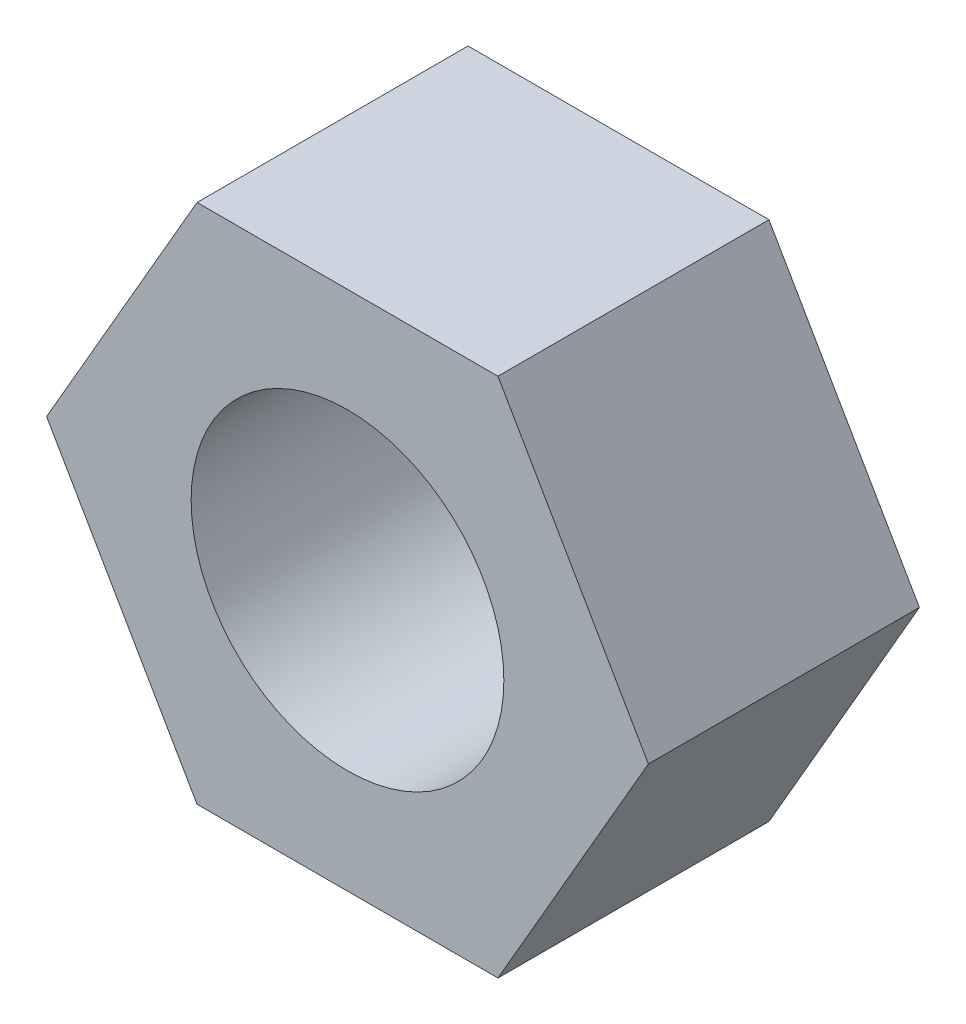
ISO-10303-21;
HEADER;
FILE_DESCRIPTION(('STEP AP214'),'2;1');
FILE_NAME('part.step','',(''),(''),'','','');
FILE_SCHEMA(('AUTOMOTIVE_DESIGN { 1 0 10303 214 1 1 1 1 }'));
ENDSEC;
DATA;
#1=APPLICATION_CONTEXT('core data for automotive mechanical design processes');
#2=APPLICATION_PROTOCOL_DEFINITION('international standard','automotive_design',2000,#1);
#3=PRODUCT_CONTEXT('',#1,'mechanical');
#4=PRODUCT('Part','Part','',(#3));
#5=PRODUCT_RELATED_PRODUCT_CATEGORY('part','',(#4));
#6=PRODUCT_DEFINITION_FORMATION('','',#4);
#7=PRODUCT_DEFINITION_CONTEXT('part definition',#1,'design');
#8=PRODUCT_DEFINITION('design','',#6,#7);
#9=PRODUCT_DEFINITION_SHAPE('','',#8);
#10=(LENGTH_UNIT() NAMED_UNIT(*) SI_UNIT(.MILLI.,.METRE.));
#11=(NAMED_UNIT(*) PLANE_ANGLE_UNIT() SI_UNIT($,.RADIAN.));
#12=(NAMED_UNIT(*) SI_UNIT($,.STERADIAN.) SOLID_ANGLE_UNIT());
#13=UNCERTAINTY_MEASURE_WITH_UNIT(LENGTH_MEASURE(1.E-05),#10,'distance_accuracy_value','');
#14=(GEOMETRIC_REPRESENTATION_CONTEXT(3) GLOBAL_UNCERTAINTY_ASSIGNED_CONTEXT((#13)) GLOBAL_UNIT_ASSIGNED_CONTEXT((#10,
#11,#12)) REPRESENTATION_CONTEXT('',''));
#15=CARTESIAN_POINT('',(0.,0.,0.));
#16=DIRECTION('',(0.,0.,1.));
#17=DIRECTION('',(1.,0.,0.));
#18=AXIS2_PLACEMENT_3D('',#15,#16,#17);
#19=CARTESIAN_POINT('',(2.88675134594819,-4.99999999999997,2.6));
#20=DIRECTION('',(-0.866025403784442,0.499999999999995,0.));
#21=DIRECTION('',(-0.499999999999995,-0.866025403784442,0.));
#22=AXIS2_PLACEMENT_3D('',#19,#20,#21);
#23=PLANE('',#22);
#24=DIRECTION('',(0.499999999999995,0.866025403784441,0.));
#25=VECTOR('',#24,1.);
#26=CARTESIAN_POINT('',(2.88675134594819,-4.99999999999997,-2.6));
#27=LINE('',#26,#25);
#28=CARTESIAN_POINT('',(2.88675134594819,-4.99999999999997,-2.6));
#29=VERTEX_POINT('',#28);
#30=CARTESIAN_POINT('',(5.77350269189626,0.,-2.6));
#31=VERTEX_POINT('',#30);
#32=EDGE_CURVE('E117',#29,#31,#27,.T.);
#33=ORIENTED_EDGE('',*,*,#32,.T.);
#34=DIRECTION('',(0.,0.,-1.));
#35=VECTOR('',#34,1.);
#36=CARTESIAN_POINT('',(5.77350269189626,0.,2.6));
#37=LINE('',#36,#35);
#38=CARTESIAN_POINT('',(5.77350269189626,0.,2.6));
#39=VERTEX_POINT('',#38);
#40=EDGE_CURVE('E11',#39,#31,#37,.T.);
#41=ORIENTED_EDGE('',*,*,#40,.F.);
#42=DIRECTION('',(0.499999999999995,0.866025403784441,0.));
#43=VECTOR('',#42,1.);
#44=CARTESIAN_POINT('',(2.88675134594819,-4.99999999999997,2.6));
#45=LINE('',#44,#43);
#46=CARTESIAN_POINT('',(2.88675134594819,-4.99999999999997,2.6));
#47=VERTEX_POINT('',#46);
#48=EDGE_CURVE('E128',#47,#39,#45,.T.);
#49=ORIENTED_EDGE('',*,*,#48,.F.);
#50=DIRECTION('',(0.,0.,-1.));
#51=VECTOR('',#50,1.);
#52=CARTESIAN_POINT('',(2.88675134594819,-4.99999999999997,2.6));
#53=LINE('',#52,#51);
#54=EDGE_CURVE('E113',#47,#29,#53,.T.);
#55=ORIENTED_EDGE('',*,*,#54,.T.);
#56=EDGE_LOOP('',(#33,#41,#49,#55));
#57=FACE_BOUND('',#56,.T.);
#58=ADVANCED_FACE('F33',(#57),#23,.F.);
#59=CARTESIAN_POINT('',(5.77350269189626,0.,2.6));
#60=DIRECTION('',(-0.866025403784438,-0.500000000000001,0.));
#61=DIRECTION('',(0.500000000000001,-0.866025403784438,0.));
#62=AXIS2_PLACEMENT_3D('',#59,#60,#61);
#63=PLANE('',#62);
#64=DIRECTION('',(-0.500000000000001,0.866025403784438,0.));
#65=VECTOR('',#64,1.);
#66=CARTESIAN_POINT('',(5.77350269189626,0.,-2.6));
#67=LINE('',#66,#65);
#68=CARTESIAN_POINT('',(2.88675134594812,5.00000000000001,-2.6));
#69=VERTEX_POINT('',#68);
#70=EDGE_CURVE('E120',#31,#69,#67,.T.);
#71=ORIENTED_EDGE('',*,*,#70,.T.);
#72=DIRECTION('',(0.,0.,-1.));
#73=VECTOR('',#72,1.);
#74=CARTESIAN_POINT('',(2.88675134594812,5.00000000000001,2.6));
#75=LINE('',#74,#73);
#76=CARTESIAN_POINT('',(2.88675134594812,5.00000000000001,2.6));
#77=VERTEX_POINT('',#76);
#78=EDGE_CURVE('E41',#77,#69,#75,.T.);
#79=ORIENTED_EDGE('',*,*,#78,.F.);
#80=DIRECTION('',(-0.500000000000001,0.866025403784438,0.));
#81=VECTOR('',#80,1.);
#82=CARTESIAN_POINT('',(5.77350269189626,0.,2.6));
#83=LINE('',#82,#81);
#84=EDGE_CURVE('E86',#39,#77,#83,.T.);
#85=ORIENTED_EDGE('',*,*,#84,.F.);
#86=ORIENTED_EDGE('',*,*,#40,.T.);
#87=EDGE_LOOP('',(#71,#79,#85,#86));
#88=FACE_BOUND('',#87,.T.);
#89=ADVANCED_FACE('F153',(#88),#63,.F.);
#90=CARTESIAN_POINT('',(2.88675134594812,5.00000000000001,2.6));
#91=DIRECTION('',(0.,-1.,0.));
#92=DIRECTION('',(1.,0.,0.));
#93=AXIS2_PLACEMENT_3D('',#90,#91,#92);
#94=PLANE('',#93);
#95=DIRECTION('',(-1.,0.,0.));
#96=VECTOR('',#95,1.);
#97=CARTESIAN_POINT('',(2.88675134594812,5.00000000000001,-2.6));
#98=LINE('',#97,#96);
#99=CARTESIAN_POINT('',(-2.88675134594815,4.99999999999999,-2.6));
#100=VERTEX_POINT('',#99);
#101=EDGE_CURVE('E123',#69,#100,#98,.T.);
#102=ORIENTED_EDGE('',*,*,#101,.T.);
#103=DIRECTION('',(0.,0.,-1.));
#104=VECTOR('',#103,1.);
#105=CARTESIAN_POINT('',(-2.88675134594815,4.99999999999999,2.6));
#106=LINE('',#105,#104);
#107=CARTESIAN_POINT('',(-2.88675134594815,4.99999999999999,2.6));
#108=VERTEX_POINT('',#107);
#109=EDGE_CURVE('E108',#108,#100,#106,.T.);
#110=ORIENTED_EDGE('',*,*,#109,.F.);
#111=DIRECTION('',(-1.,0.,0.));
#112=VECTOR('',#111,1.);
#113=CARTESIAN_POINT('',(2.88675134594812,5.00000000000001,2.6));
#114=LINE('',#113,#112);
#115=EDGE_CURVE('E99',#77,#108,#114,.T.);
#116=ORIENTED_EDGE('',*,*,#115,.F.);
#117=ORIENTED_EDGE('',*,*,#78,.T.);
#118=EDGE_LOOP('',(#102,#110,#116,#117));
#119=FACE_BOUND('',#118,.T.);
#120=ADVANCED_FACE('F134',(#119),#94,.F.);
#121=CARTESIAN_POINT('',(-2.88675134594815,4.99999999999999,2.6));
#122=DIRECTION('',(0.866025403784442,-0.499999999999995,0.));
#123=DIRECTION('',(0.499999999999995,0.866025403784442,0.));
#124=AXIS2_PLACEMENT_3D('',#121,#122,#123);
#125=PLANE('',#124);
#126=DIRECTION('',(-0.499999999999995,-0.866025403784442,0.));
#127=VECTOR('',#126,1.);
#128=CARTESIAN_POINT('',(-2.88675134594815,4.99999999999999,-2.6));
#129=LINE('',#128,#127);
#130=CARTESIAN_POINT('',(-5.77350269189626,0.,-2.6));
#131=VERTEX_POINT('',#130);
#132=EDGE_CURVE('E107',#100,#131,#129,.T.);
#133=ORIENTED_EDGE('',*,*,#132,.T.);
#134=DIRECTION('',(0.,0.,-1.));
#135=VECTOR('',#134,1.);
#136=CARTESIAN_POINT('',(-5.77350269189626,0.,2.6));
#137=LINE('',#136,#135);
#138=CARTESIAN_POINT('',(-5.77350269189626,0.,2.6));
#139=VERTEX_POINT('',#138);
#140=EDGE_CURVE('E104',#139,#131,#137,.T.);
#141=ORIENTED_EDGE('',*,*,#140,.F.);
#142=DIRECTION('',(-0.499999999999995,-0.866025403784442,0.));
#143=VECTOR('',#142,1.);
#144=CARTESIAN_POINT('',(-2.88675134594815,4.99999999999999,2.6));
#145=LINE('',#144,#143);
#146=EDGE_CURVE('E93',#108,#139,#145,.T.);
#147=ORIENTED_EDGE('',*,*,#146,.F.);
#148=ORIENTED_EDGE('',*,*,#109,.T.);
#149=EDGE_LOOP('',(#133,#141,#147,#148));
#150=FACE_BOUND('',#149,.T.);
#151=ADVANCED_FACE('F105',(#150),#125,.F.);
#152=CARTESIAN_POINT('',(-5.77350269189626,0.,2.6));
#153=DIRECTION('',(0.866025403784435,0.500000000000007,0.));
#154=DIRECTION('',(-0.500000000000007,0.866025403784435,0.));
#155=AXIS2_PLACEMENT_3D('',#152,#153,#154);
#156=PLANE('',#155);
#157=DIRECTION('',(0.500000000000007,-0.866025403784435,0.));
#158=VECTOR('',#157,1.);
#159=CARTESIAN_POINT('',(-5.77350269189626,0.,-2.6));
#160=LINE('',#159,#158);
#161=CARTESIAN_POINT('',(-2.88675134594808,-5.00000000000003,-2.6));
#162=VERTEX_POINT('',#161);
#163=EDGE_CURVE('E72',#131,#162,#160,.T.);
#164=ORIENTED_EDGE('',*,*,#163,.T.);
#165=DIRECTION('',(0.,0.,-1.));
#166=VECTOR('',#165,1.);
#167=CARTESIAN_POINT('',(-2.88675134594808,-5.00000000000003,2.6));
#168=LINE('',#167,#166);
#169=CARTESIAN_POINT('',(-2.88675134594808,-5.00000000000003,2.6));
#170=VERTEX_POINT('',#169);
#171=EDGE_CURVE('E109',#170,#162,#168,.T.);
#172=ORIENTED_EDGE('',*,*,#171,.F.);
#173=DIRECTION('',(0.500000000000007,-0.866025403784435,0.));
#174=VECTOR('',#173,1.);
#175=CARTESIAN_POINT('',(-5.77350269189626,0.,2.6));
#176=LINE('',#175,#174);
#177=EDGE_CURVE('E97',#139,#170,#176,.T.);
#178=ORIENTED_EDGE('',*,*,#177,.F.);
#179=ORIENTED_EDGE('',*,*,#140,.T.);
#180=EDGE_LOOP('',(#164,#172,#178,#179));
#181=FACE_BOUND('',#180,.T.);
#182=ADVANCED_FACE('F111',(#181),#156,.F.);
#183=CARTESIAN_POINT('',(-2.88675134594808,-5.00000000000003,2.6));
#184=DIRECTION('',(0.,1.,0.));
#185=DIRECTION('',(-1.,0.,0.));
#186=AXIS2_PLACEMENT_3D('',#183,#184,#185);
#187=PLANE('',#186);
#188=DIRECTION('',(1.,0.,0.));
#189=VECTOR('',#188,1.);
#190=CARTESIAN_POINT('',(-2.88675134594808,-5.00000000000003,-2.6));
#191=LINE('',#190,#189);
#192=EDGE_CURVE('E78',#162,#29,#191,.T.);
#193=ORIENTED_EDGE('',*,*,#192,.T.);
#194=ORIENTED_EDGE('',*,*,#54,.F.);
#195=DIRECTION('',(1.,0.,0.));
#196=VECTOR('',#195,1.);
#197=CARTESIAN_POINT('',(-2.88675134594808,-5.00000000000003,2.6));
#198=LINE('',#197,#196);
#199=EDGE_CURVE('E49',#170,#47,#198,.T.);
#200=ORIENTED_EDGE('',*,*,#199,.F.);
#201=ORIENTED_EDGE('',*,*,#171,.T.);
#202=EDGE_LOOP('',(#193,#194,#200,#201));
#203=FACE_BOUND('',#202,.T.);
#204=ADVANCED_FACE('F141',(#203),#187,.F.);
#205=CARTESIAN_POINT('',(0.,0.,2.6));
#206=DIRECTION('',(0.,0.,1.));
#207=DIRECTION('',(1.,0.,0.));
#208=AXIS2_PLACEMENT_3D('',#205,#206,#207);
#209=PLANE('',#208);
#210=CARTESIAN_POINT('',(0.,0.,2.6));
#211=DIRECTION('',(0.,0.,1.));
#212=DIRECTION('',(1.,0.,0.));
#213=AXIS2_PLACEMENT_3D('',#210,#211,#212);
#214=CIRCLE('',#213,3.);
#215=CARTESIAN_POINT('',(3.,0.,2.6));
#216=VERTEX_POINT('',#215);
#217=EDGE_CURVE('E208',#216,#216,#214,.T.);
#218=ORIENTED_EDGE('',*,*,#217,.F.);
#219=EDGE_LOOP('',(#218));
#220=FACE_BOUND('',#219,.T.);
#221=ORIENTED_EDGE('',*,*,#48,.T.);
#222=ORIENTED_EDGE('',*,*,#84,.T.);
#223=ORIENTED_EDGE('',*,*,#115,.T.);
#224=ORIENTED_EDGE('',*,*,#146,.T.);
#225=ORIENTED_EDGE('',*,*,#177,.T.);
#226=ORIENTED_EDGE('',*,*,#199,.T.);
#227=EDGE_LOOP('',(#221,#222,#223,#224,#225,#226));
#228=FACE_BOUND('',#227,.T.);
#229=ADVANCED_FACE('F95',(#220,#228),#209,.T.);
#230=CARTESIAN_POINT('',(0.,0.,-2.6));
#231=DIRECTION('',(0.,0.,1.));
#232=DIRECTION('',(1.,0.,0.));
#233=AXIS2_PLACEMENT_3D('',#230,#231,#232);
#234=PLANE('',#233);
#235=CARTESIAN_POINT('',(0.,0.,-2.6));
#236=DIRECTION('',(0.,0.,1.));
#237=DIRECTION('',(1.,0.,0.));
#238=AXIS2_PLACEMENT_3D('',#235,#236,#237);
#239=CIRCLE('',#238,3.);
#240=CARTESIAN_POINT('',(3.,0.,-2.6));
#241=VERTEX_POINT('',#240);
#242=EDGE_CURVE('E121',#241,#241,#239,.T.);
#243=ORIENTED_EDGE('',*,*,#242,.T.);
#244=EDGE_LOOP('',(#243));
#245=FACE_BOUND('',#244,.T.);
#246=ORIENTED_EDGE('',*,*,#32,.F.);
#247=ORIENTED_EDGE('',*,*,#192,.F.);
#248=ORIENTED_EDGE('',*,*,#163,.F.);
#249=ORIENTED_EDGE('',*,*,#132,.F.);
#250=ORIENTED_EDGE('',*,*,#101,.F.);
#251=ORIENTED_EDGE('',*,*,#70,.F.);
#252=EDGE_LOOP('',(#246,#247,#248,#249,#250,#251));
#253=FACE_BOUND('',#252,.T.);
#254=ADVANCED_FACE('F137',(#245,#253),#234,.F.);
#255=CARTESIAN_POINT('',(0.,0.,-2.6));
#256=DIRECTION('',(0.,0.,1.));
#257=DIRECTION('',(1.,0.,0.));
#258=AXIS2_PLACEMENT_3D('',#255,#256,#257);
#259=CYLINDRICAL_SURFACE('',#258,3.);
#260=ORIENTED_EDGE('',*,*,#242,.F.);
#261=EDGE_LOOP('',(#260));
#262=FACE_BOUND('',#261,.T.);
#263=ORIENTED_EDGE('',*,*,#217,.T.);
#264=EDGE_LOOP('',(#263));
#265=FACE_BOUND('',#264,.T.);
#266=ADVANCED_FACE('F190',(#262,#265),#259,.F.);
#267=CLOSED_SHELL('',(#58,#89,#120,#151,#182,#204,#229,#254,#266));
#268=MANIFOLD_SOLID_BREP('B2',#267);
#269=ADVANCED_BREP_SHAPE_REPRESENTATION('',(#18,#268),#14);
#270=SHAPE_DEFINITION_REPRESENTATION(#9,#269);
ENDSEC;
END-ISO-10303-21;
